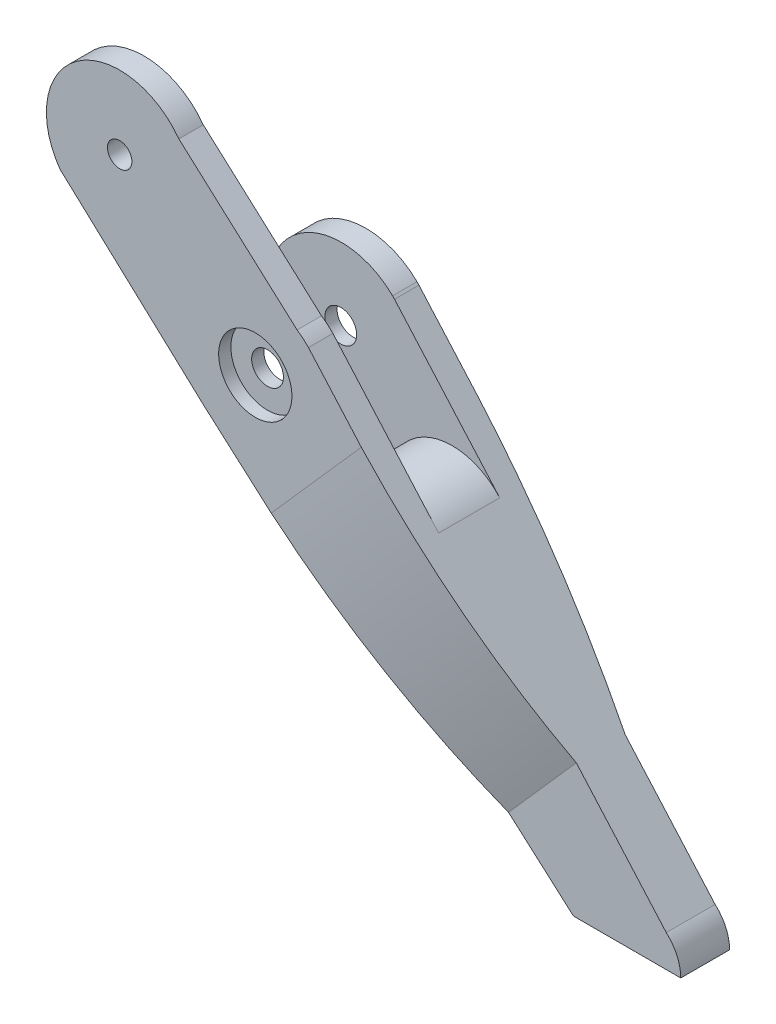
ISO-10303-21;
HEADER;
FILE_DESCRIPTION(('STEP AP214'),'2;1');
FILE_NAME('part.step','',(''),(''),'','','');
FILE_SCHEMA(('AUTOMOTIVE_DESIGN { 1 0 10303 214 1 1 1 1 }'));
ENDSEC;
DATA;
#1=APPLICATION_CONTEXT('core data for automotive mechanical design processes');
#2=APPLICATION_PROTOCOL_DEFINITION('international standard','automotive_design',2000,#1);
#3=PRODUCT_CONTEXT('',#1,'mechanical');
#4=PRODUCT('Part','Part','',(#3));
#5=PRODUCT_RELATED_PRODUCT_CATEGORY('part','',(#4));
#6=PRODUCT_DEFINITION_FORMATION('','',#4);
#7=PRODUCT_DEFINITION_CONTEXT('part definition',#1,'design');
#8=PRODUCT_DEFINITION('design','',#6,#7);
#9=PRODUCT_DEFINITION_SHAPE('','',#8);
#10=(LENGTH_UNIT() NAMED_UNIT(*) SI_UNIT(.MILLI.,.METRE.));
#11=(NAMED_UNIT(*) PLANE_ANGLE_UNIT() SI_UNIT($,.RADIAN.));
#12=(NAMED_UNIT(*) SI_UNIT($,.STERADIAN.) SOLID_ANGLE_UNIT());
#13=UNCERTAINTY_MEASURE_WITH_UNIT(LENGTH_MEASURE(1.E-05),#10,'distance_accuracy_value','');
#14=(GEOMETRIC_REPRESENTATION_CONTEXT(3) GLOBAL_UNCERTAINTY_ASSIGNED_CONTEXT((#13)) GLOBAL_UNIT_ASSIGNED_CONTEXT((#10,
#11,#12)) REPRESENTATION_CONTEXT('',''));
#15=CARTESIAN_POINT('',(0.,0.,0.));
#16=DIRECTION('',(0.,0.,1.));
#17=DIRECTION('',(1.,0.,0.));
#18=AXIS2_PLACEMENT_3D('',#15,#16,#17);
#19=CARTESIAN_POINT('',(-27.9049421413444,43.6443859527806,-3.));
#20=DIRECTION('',(0.,0.,1.));
#21=DIRECTION('',(1.,0.,0.));
#22=AXIS2_PLACEMENT_3D('',#19,#20,#21);
#23=CYLINDRICAL_SURFACE('',#22,2.6);
#24=CARTESIAN_POINT('',(-27.9049421413444,43.6443859527806,10.));
#25=DIRECTION('',(0.,0.,-1.));
#26=DIRECTION('',(-1.,0.,0.));
#27=AXIS2_PLACEMENT_3D('',#24,#25,#26);
#28=CIRCLE('',#27,2.6);
#29=CARTESIAN_POINT('',(-30.5049421413444,43.6443859527806,10.));
#30=VERTEX_POINT('',#29);
#31=EDGE_CURVE('E445',#30,#30,#28,.F.);
#32=ORIENTED_EDGE('',*,*,#31,.F.);
#33=EDGE_LOOP('',(#32));
#34=FACE_BOUND('',#33,.T.);
#35=CARTESIAN_POINT('',(-27.9049421413444,43.6443859527806,12.));
#36=DIRECTION('',(0.,0.,1.));
#37=DIRECTION('',(1.,0.,0.));
#38=AXIS2_PLACEMENT_3D('',#35,#36,#37);
#39=CIRCLE('',#38,2.6);
#40=CARTESIAN_POINT('',(-25.3049421413444,43.6443859527806,12.));
#41=VERTEX_POINT('',#40);
#42=EDGE_CURVE('E68',#41,#41,#39,.F.);
#43=ORIENTED_EDGE('',*,*,#42,.F.);
#44=EDGE_LOOP('',(#43));
#45=FACE_BOUND('',#44,.T.);
#46=ADVANCED_FACE('F63',(#34,#45),#23,.F.);
#47=CARTESIAN_POINT('',(-27.9049421413444,43.6443859527806,-4.));
#48=DIRECTION('',(0.,0.,1.));
#49=DIRECTION('',(1.,0.,0.));
#50=AXIS2_PLACEMENT_3D('',#47,#48,#49);
#51=CYLINDRICAL_SURFACE('',#50,2.6);
#52=CARTESIAN_POINT('',(-27.9049421413444,43.6443859527806,0.));
#53=DIRECTION('',(0.,0.,1.));
#54=DIRECTION('',(1.,0.,0.));
#55=AXIS2_PLACEMENT_3D('',#52,#53,#54);
#56=CIRCLE('',#55,2.6);
#57=CARTESIAN_POINT('',(-25.3049421413444,43.6443859527806,0.));
#58=VERTEX_POINT('',#57);
#59=EDGE_CURVE('E247',#58,#58,#56,.T.);
#60=ORIENTED_EDGE('',*,*,#59,.T.);
#61=EDGE_LOOP('',(#60));
#62=FACE_BOUND('',#61,.T.);
#63=CARTESIAN_POINT('',(-27.9049421413444,43.6443859527806,-2.));
#64=DIRECTION('',(0.,0.,-1.));
#65=DIRECTION('',(-1.,0.,0.));
#66=AXIS2_PLACEMENT_3D('',#63,#64,#65);
#67=CIRCLE('',#66,2.6);
#68=CARTESIAN_POINT('',(-30.5049421413444,43.6443859527806,-2.));
#69=VERTEX_POINT('',#68);
#70=EDGE_CURVE('E226',#69,#69,#67,.F.);
#71=ORIENTED_EDGE('',*,*,#70,.F.);
#72=EDGE_LOOP('',(#71));
#73=FACE_BOUND('',#72,.T.);
#74=ADVANCED_FACE('F259',(#62,#73),#51,.F.);
#75=CARTESIAN_POINT('',(-9.65317009659343,25.3894867406212,13.4327814635894));
#76=DIRECTION('',(0.,0.,-1.));
#77=DIRECTION('',(-1.,0.,0.));
#78=AXIS2_PLACEMENT_3D('',#75,#76,#77);
#79=CYLINDRICAL_SURFACE('',#78,10.3712235631253);
#80=DIRECTION('',(0.,0.,-1.));
#81=VECTOR('',#80,1.);
#82=CARTESIAN_POINT('',(-16.5173740886252,17.614849658925,14.));
#83=LINE('',#82,#81);
#84=CARTESIAN_POINT('',(-16.5173740886257,17.6148496589244,10.));
#85=VERTEX_POINT('',#84);
#86=CARTESIAN_POINT('',(-16.5173740886252,17.614849658925,0.));
#87=VERTEX_POINT('',#86);
#88=EDGE_CURVE('E289',#85,#87,#83,.T.);
#89=ORIENTED_EDGE('',*,*,#88,.F.);
#90=CARTESIAN_POINT('',(-9.65317009659343,25.3894867406212,10.));
#91=DIRECTION('',(0.,0.,-1.));
#92=DIRECTION('',(-1.,0.,0.));
#93=AXIS2_PLACEMENT_3D('',#90,#91,#92);
#94=CIRCLE('',#93,10.3712235631253);
#95=CARTESIAN_POINT('',(-1.87216606940496,32.2464725598571,10.));
#96=VERTEX_POINT('',#95);
#97=EDGE_CURVE('E12',#96,#85,#94,.F.);
#98=ORIENTED_EDGE('',*,*,#97,.F.);
#99=DIRECTION('',(0.,0.,-1.));
#100=VECTOR('',#99,1.);
#101=CARTESIAN_POINT('',(-1.87216606940547,32.2464725598567,14.));
#102=LINE('',#101,#100);
#103=CARTESIAN_POINT('',(-1.87216606940547,32.2464725598567,0.));
#104=VERTEX_POINT('',#103);
#105=EDGE_CURVE('E296',#104,#96,#102,.F.);
#106=ORIENTED_EDGE('',*,*,#105,.F.);
#107=CARTESIAN_POINT('',(-9.65317009659343,25.3894867406212,0.));
#108=DIRECTION('',(0.,0.,-1.));
#109=DIRECTION('',(-1.,0.,0.));
#110=AXIS2_PLACEMENT_3D('',#107,#108,#109);
#111=CIRCLE('',#110,10.3712235631253);
#112=EDGE_CURVE('E74',#87,#104,#111,.T.);
#113=ORIENTED_EDGE('',*,*,#112,.F.);
#114=EDGE_LOOP('',(#89,#98,#106,#113));
#115=FACE_BOUND('',#114,.T.);
#116=ADVANCED_FACE('F66',(#115),#79,.T.);
#117=CARTESIAN_POINT('',(0.671572776221725,-6.94016349284711,0.));
#118=CARTESIAN_POINT('',(-13.1859163983363,8.78470190959758,-3.88183674365132));
#119=CARTESIAN_POINT('',(-27.2509351479165,24.7450626888124,-4.));
#120=B_SPLINE_CURVE_WITH_KNOTS('',2,(#117,#118,#119),.UNSPECIFIED.,.F.,.F.,(3,3),(0.,1.),.UNSPECIFIED.);
#121=DIRECTION('',(0.750249377985996,0.661154952209862,0.));
#122=VECTOR('',#121,1.);
#123=SURFACE_OF_LINEAR_EXTRUSION('',#120,#122);
#124=CARTESIAN_POINT('',(-25.9208757969903,25.9171733928007,-4.));
#125=CARTESIAN_POINT('',(-24.588837421596,24.7411206667581,-3.99022062547783));
#126=CARTESIAN_POINT('',(-23.2568769003931,23.5651366779498,-3.96101966543624));
#127=CARTESIAN_POINT('',(-20.5937119018394,21.2138362092052,-3.86367306561646));
#128=CARTESIAN_POINT('',(-19.2625074510679,20.0385197527356,-3.79552613241683));
#129=CARTESIAN_POINT('',(-16.6018779997232,17.6894579110923,-3.62020875542696));
#130=CARTESIAN_POINT('',(-15.2724526359131,16.5157122052179,-3.51304812707628));
#131=CARTESIAN_POINT('',(-12.6157363839593,14.1701053156962,-3.25970066968625));
#132=CARTESIAN_POINT('',(-11.2884454284125,12.9982440725391,-3.11351509837658));
#133=CARTESIAN_POINT('',(-8.62731774653096,10.6487423446343,-2.78102212776162));
#134=CARTESIAN_POINT('',(-7.29350023196055,9.4711188218964,-2.59444105487763));
#135=CARTESIAN_POINT('',(-4.62932807548959,7.11892913641746,-2.18192237635344));
#136=CARTESIAN_POINT('',(-3.2989733376645,5.94436288898497,-1.95598587295653));
#137=CARTESIAN_POINT('',(-0.639728528010104,3.59652354337824,-1.46448977224725));
#138=CARTESIAN_POINT('',(0.689153570870428,2.42325748449679,-1.19885343086207));
#139=CARTESIAN_POINT('',(3.34224622642037,0.0808498574795639,-0.628590607779087));
#140=CARTESIAN_POINT('',(4.66645665337855,-1.08829159613454,-0.323963052091235));
#141=CARTESIAN_POINT('',(5.98800005315479,-2.25507833936965,0.));
#142=B_SPLINE_CURVE_WITH_KNOTS('',3,(#124,#125,#126,#127,#128,#129,#130,#131,#132,#133,#134,
#135,#136,#137,#138,#139,#140,#141),.UNSPECIFIED.,.F.,.F.,(4,2,2,2,2,2,2,2,4),(0.,
5.3307236354528,10.6616243180409,15.9911847273041,21.3205733916092,26.6872655196563,
32.0538073647705,37.4308608113082,42.8080623975034),.UNSPECIFIED.);
#143=CARTESIAN_POINT('',(-24.7128415251115,24.850603521512,-3.98579838559611));
#144=VERTEX_POINT('',#143);
#145=CARTESIAN_POINT('',(5.98800005315479,-2.25507833936965,0.));
#146=VERTEX_POINT('',#145);
#147=EDGE_CURVE('E236',#144,#146,#142,.T.);
#148=ORIENTED_EDGE('',*,*,#147,.F.);
#149=CARTESIAN_POINT('',(-24.7128415251115,24.850603521512,-3.98579838559611));
#150=CARTESIAN_POINT('',(-22.1348600164907,27.4776327844446,-3.98905232768544));
#151=CARTESIAN_POINT('',(-19.5568783081088,30.104662250939,-3.9918627665971));
#152=CARTESIAN_POINT('',(-14.4009144918225,35.3587215910514,-3.99659663806507));
#153=CARTESIAN_POINT('',(-11.8229323839181,37.9857514646694,-3.99852007062137));
#154=CARTESIAN_POINT('',(-9.2449500762526,40.6127815418491,-4.));
#155=B_SPLINE_CURVE_WITH_KNOTS('',3,(#149,#150,#151,#152,#153,#154),.UNSPECIFIED.,.F.,.F.,(4,2,
4),(0.,11.0419895239191,22.0839790478383),.UNSPECIFIED.);
#156=CARTESIAN_POINT('',(-9.24495007625259,40.6127815418491,-4.));
#157=VERTEX_POINT('',#156);
#158=EDGE_CURVE('E280',#144,#157,#155,.T.);
#159=ORIENTED_EDGE('',*,*,#158,.T.);
#160=CARTESIAN_POINT('',(18.6775578478857,8.9275553601896,0.));
#161=CARTESIAN_POINT('',(4.82006867332763,24.6524207626343,-3.88183674365132));
#162=CARTESIAN_POINT('',(-9.2449500762526,40.6127815418491,-4.));
#163=B_SPLINE_CURVE_WITH_KNOTS('',2,(#160,#161,#162),.UNSPECIFIED.,.F.,.F.,(3,3),(0.,1.),.UNSPECIFIED.);
#164=CARTESIAN_POINT('',(18.6775578478857,8.9275553601896,0.));
#165=VERTEX_POINT('',#164);
#166=EDGE_CURVE('E400',#165,#157,#163,.T.);
#167=ORIENTED_EDGE('',*,*,#166,.F.);
#168=DIRECTION('',(0.750249377985996,0.661154952209862,0.));
#169=VECTOR('',#168,1.);
#170=CARTESIAN_POINT('',(0.671572776221735,-6.9401634928471,0.));
#171=LINE('',#170,#169);
#172=EDGE_CURVE('E290',#146,#165,#171,.T.);
#173=ORIENTED_EDGE('',*,*,#172,.F.);
#174=EDGE_LOOP('',(#148,#159,#167,#173));
#175=FACE_BOUND('',#174,.T.);
#176=ADVANCED_FACE('F249',(#175),#123,.T.);
#177=CARTESIAN_POINT('',(-27.7916222926783,43.5310661041145,14.));
#178=DIRECTION('',(0.,0.,-1.));
#179=DIRECTION('',(-1.,0.,0.));
#180=AXIS2_PLACEMENT_3D('',#177,#178,#179);
#181=CYLINDRICAL_SURFACE('',#180,12.);
#182=CARTESIAN_POINT('',(-27.7916222926783,43.5310661041145,10.));
#183=DIRECTION('',(0.,0.,-1.));
#184=DIRECTION('',(-1.,0.,0.));
#185=AXIS2_PLACEMENT_3D('',#182,#183,#184);
#186=CIRCLE('',#185,12.);
#187=CARTESIAN_POINT('',(-21.055875116344,53.4623152690737,10.));
#188=VERTEX_POINT('',#187);
#189=CARTESIAN_POINT('',(-19.1937777895665,51.9022709098942,10.));
#190=VERTEX_POINT('',#189);
#191=EDGE_CURVE('E453',#188,#190,#186,.T.);
#192=ORIENTED_EDGE('',*,*,#191,.F.);
#193=DIRECTION('',(0.,0.,1.));
#194=VECTOR('',#193,1.);
#195=CARTESIAN_POINT('',(-21.055875116344,53.4623152690737,10.));
#196=LINE('',#195,#194);
#197=CARTESIAN_POINT('',(-21.055875116344,53.4623152690737,14.));
#198=VERTEX_POINT('',#197);
#199=EDGE_CURVE('E208',#188,#198,#196,.T.);
#200=ORIENTED_EDGE('',*,*,#199,.T.);
#201=CARTESIAN_POINT('',(-27.7916222926783,43.5310661041145,14.));
#202=DIRECTION('',(0.,0.,1.));
#203=DIRECTION('',(-1.,0.,0.));
#204=AXIS2_PLACEMENT_3D('',#201,#202,#203);
#205=CIRCLE('',#204,12.);
#206=CARTESIAN_POINT('',(-19.1937777895665,51.9022709098942,14.));
#207=VERTEX_POINT('',#206);
#208=EDGE_CURVE('E432',#207,#198,#205,.T.);
#209=ORIENTED_EDGE('',*,*,#208,.F.);
#210=DIRECTION('',(0.,0.,-1.));
#211=VECTOR('',#210,1.);
#212=CARTESIAN_POINT('',(-19.1937777895665,51.9022709098942,14.));
#213=LINE('',#212,#211);
#214=EDGE_CURVE('E430',#207,#190,#213,.T.);
#215=ORIENTED_EDGE('',*,*,#214,.T.);
#216=EDGE_LOOP('',(#192,#200,#209,#215));
#217=FACE_BOUND('',#216,.T.);
#218=ADVANCED_FACE('F354',(#217),#181,.T.);
#219=CARTESIAN_POINT('',(18.2005205169488,-13.0374763908109,14.));
#220=DIRECTION('',(0.,1.,0.));
#221=DIRECTION('',(-1.,0.,0.));
#222=AXIS2_PLACEMENT_3D('',#219,#220,#221);
#223=PLANE('',#222);
#224=DIRECTION('',(0.,0.,-1.));
#225=VECTOR('',#224,1.);
#226=CARTESIAN_POINT('',(35.7769202021713,-13.0374763908109,14.));
#227=LINE('',#226,#225);
#228=CARTESIAN_POINT('',(35.7769202021713,-13.0374763908109,8.));
#229=VERTEX_POINT('',#228);
#230=CARTESIAN_POINT('',(35.7769202021713,-13.0374763908109,0.));
#231=VERTEX_POINT('',#230);
#232=EDGE_CURVE('E443',#229,#231,#227,.T.);
#233=ORIENTED_EDGE('',*,*,#232,.F.);
#234=DIRECTION('',(-1.,0.,0.));
#235=VECTOR('',#234,1.);
#236=CARTESIAN_POINT('',(18.2005205169488,-13.0374763908109,8.));
#237=LINE('',#236,#235);
#238=CARTESIAN_POINT('',(18.2005205169488,-13.0374763908109,8.));
#239=VERTEX_POINT('',#238);
#240=EDGE_CURVE('E449',#229,#239,#237,.T.);
#241=ORIENTED_EDGE('',*,*,#240,.T.);
#242=DIRECTION('',(0.,0.,-1.));
#243=VECTOR('',#242,1.);
#244=CARTESIAN_POINT('',(18.2005205169488,-13.0374763908109,14.));
#245=LINE('',#244,#243);
#246=CARTESIAN_POINT('',(18.2005205169488,-13.0374763908109,0.));
#247=VERTEX_POINT('',#246);
#248=EDGE_CURVE('E417',#239,#247,#245,.T.);
#249=ORIENTED_EDGE('',*,*,#248,.T.);
#250=DIRECTION('',(1.,0.,0.));
#251=VECTOR('',#250,1.);
#252=CARTESIAN_POINT('',(18.2005205169488,-13.0374763908109,0.));
#253=LINE('',#252,#251);
#254=EDGE_CURVE('E465',#247,#231,#253,.T.);
#255=ORIENTED_EDGE('',*,*,#254,.T.);
#256=EDGE_LOOP('',(#233,#241,#249,#255));
#257=FACE_BOUND('',#256,.T.);
#258=ADVANCED_FACE('F357',(#257),#223,.F.);
#259=CARTESIAN_POINT('',(28.7769202022435,-13.0374763908109,14.));
#260=DIRECTION('',(0.,0.,-1.));
#261=DIRECTION('',(-1.,0.,0.));
#262=AXIS2_PLACEMENT_3D('',#259,#260,#261);
#263=CYLINDRICAL_SURFACE('',#262,6.99999999992777);
#264=DIRECTION('',(0.,0.,-1.));
#265=VECTOR('',#264,1.);
#266=CARTESIAN_POINT('',(33.4098767334832,-7.79002807961883,14.));
#267=LINE('',#266,#265);
#268=CARTESIAN_POINT('',(33.4098767334832,-7.79002807961883,8.));
#269=VERTEX_POINT('',#268);
#270=CARTESIAN_POINT('',(33.4098767334832,-7.79002807961883,0.));
#271=VERTEX_POINT('',#270);
#272=EDGE_CURVE('E440',#269,#271,#267,.T.);
#273=ORIENTED_EDGE('',*,*,#272,.F.);
#274=CARTESIAN_POINT('',(28.7769202022435,-13.0374763908109,8.));
#275=DIRECTION('',(0.,0.,-1.));
#276=DIRECTION('',(-1.,0.,0.));
#277=AXIS2_PLACEMENT_3D('',#274,#275,#276);
#278=CIRCLE('',#277,6.99999999992777);
#279=EDGE_CURVE('E455',#269,#229,#278,.T.);
#280=ORIENTED_EDGE('',*,*,#279,.T.);
#281=ORIENTED_EDGE('',*,*,#232,.T.);
#282=CARTESIAN_POINT('',(28.7769202022435,-13.0374763908109,0.));
#283=DIRECTION('',(0.,0.,1.));
#284=DIRECTION('',(1.,0.,0.));
#285=AXIS2_PLACEMENT_3D('',#282,#283,#284);
#286=CIRCLE('',#285,6.99999999992777);
#287=EDGE_CURVE('E474',#231,#271,#286,.T.);
#288=ORIENTED_EDGE('',*,*,#287,.T.);
#289=EDGE_LOOP('',(#273,#280,#281,#288));
#290=FACE_BOUND('',#289,.T.);
#291=ADVANCED_FACE('F362',(#290),#263,.T.);
#292=CARTESIAN_POINT('',(-19.1937777895665,51.9022709098942,14.));
#293=DIRECTION('',(-0.750249377985996,-0.661154952209862,0.));
#294=DIRECTION('',(0.661154952209862,-0.750249377985997,0.));
#295=AXIS2_PLACEMENT_3D('',#292,#293,#294);
#296=PLANE('',#295);
#297=ORIENTED_EDGE('',*,*,#105,.T.);
#298=DIRECTION('',(0.661154952209862,-0.750249377985997,0.));
#299=VECTOR('',#298,1.);
#300=CARTESIAN_POINT('',(-19.1937777895665,51.9022709098942,10.));
#301=LINE('',#300,#299);
#302=EDGE_CURVE('E87',#190,#96,#301,.T.);
#303=ORIENTED_EDGE('',*,*,#302,.F.);
#304=ORIENTED_EDGE('',*,*,#214,.F.);
#305=DIRECTION('',(-0.661154952209862,0.750249377985997,0.));
#306=VECTOR('',#305,1.);
#307=CARTESIAN_POINT('',(-19.1937777895665,51.9022709098942,14.));
#308=LINE('',#307,#306);
#309=CARTESIAN_POINT('',(-10.5421023651085,42.0847325491197,14.));
#310=VERTEX_POINT('',#309);
#311=EDGE_CURVE('E466',#310,#207,#308,.T.);
#312=ORIENTED_EDGE('',*,*,#311,.F.);
#313=CARTESIAN_POINT('',(-10.5421023651085,42.0847325491197,14.));
#314=CARTESIAN_POINT('',(-9.29116794678438,40.6652275357911,13.9656176360731));
#315=CARTESIAN_POINT('',(-8.04053048900444,39.246059500145,13.9045230868265));
#316=CARTESIAN_POINT('',(-5.54092311552883,36.4096156818068,13.7278499774469));
#317=CARTESIAN_POINT('',(-4.29195322597862,34.9923399287836,13.6122705728873));
#318=CARTESIAN_POINT('',(-1.79675644412734,32.1609010546142,13.3255648602548));
#319=CARTESIAN_POINT('',(-0.55052963429707,30.7467380270524,13.1544369044712));
#320=CARTESIAN_POINT('',(1.93799393706674,27.9228716167974,12.7557777541679));
#321=CARTESIAN_POINT('',(3.18029065862422,26.5131682794673,12.5282459877766));
#322=CARTESIAN_POINT('',(5.62041937882687,23.7442182044224,12.0242210117392));
#323=CARTESIAN_POINT('',(6.81841220558213,22.3847889660863,11.7495091377435));
#324=CARTESIAN_POINT('',(9.20850693344129,19.6726152511191,11.1461201042127));
#325=CARTESIAN_POINT('',(10.4006085479129,18.3198710997458,10.8174403450287));
#326=CARTESIAN_POINT('',(12.7784403387277,15.6216128229963,10.1056527901271));
#327=CARTESIAN_POINT('',(13.9641662275106,14.2761035629539,9.72251220994619));
#328=CARTESIAN_POINT('',(16.3273441235868,11.5944738773932,8.90196051998719));
#329=CARTESIAN_POINT('',(17.5047963649292,10.2583531862864,8.46455095198088));
#330=CARTESIAN_POINT('',(18.6775578478856,8.92755536018961,8.));
#331=B_SPLINE_CURVE_WITH_KNOTS('',3,(#313,#314,#315,#316,#317,#318,#319,#320,#321,#322,#323,
#324,#325,#326,#327,#328,#329,#330),.UNSPECIFIED.,.F.,.F.,(4,2,2,2,2,2,2,2,4),(0.,
5.6769352825752,11.3539585512948,17.031150230288,22.7083994720253,28.205624966388,
33.703115341433,39.2039292364952,44.7045868902376),.UNSPECIFIED.);
#332=CARTESIAN_POINT('',(18.6775578478856,8.9275553601896,8.));
#333=VERTEX_POINT('',#332);
#334=EDGE_CURVE('E365',#310,#333,#331,.T.);
#335=ORIENTED_EDGE('',*,*,#334,.T.);
#336=DIRECTION('',(0.661154952209862,-0.750249377985997,0.));
#337=VECTOR('',#336,1.);
#338=CARTESIAN_POINT('',(-19.1937777895665,51.9022709098942,8.));
#339=LINE('',#338,#337);
#340=EDGE_CURVE('E374',#333,#269,#339,.T.);
#341=ORIENTED_EDGE('',*,*,#340,.T.);
#342=ORIENTED_EDGE('',*,*,#272,.T.);
#343=DIRECTION('',(-0.661154952209862,0.750249377985997,0.));
#344=VECTOR('',#343,1.);
#345=CARTESIAN_POINT('',(-19.1937777895665,51.9022709098942,0.));
#346=LINE('',#345,#344);
#347=EDGE_CURVE('E477',#271,#165,#346,.T.);
#348=ORIENTED_EDGE('',*,*,#347,.T.);
#349=ORIENTED_EDGE('',*,*,#166,.T.);
#350=DIRECTION('',(0.661154952209862,-0.750249377985997,0.));
#351=VECTOR('',#350,1.);
#352=CARTESIAN_POINT('',(33.9875890894061,-8.44559049238946,-4.));
#353=LINE('',#352,#351);
#354=CARTESIAN_POINT('',(-19.1009491503632,51.7969330785904,-4.));
#355=VERTEX_POINT('',#354);
#356=EDGE_CURVE('E524',#355,#157,#353,.T.);
#357=ORIENTED_EDGE('',*,*,#356,.F.);
#358=DIRECTION('',(0.,0.,1.));
#359=VECTOR('',#358,1.);
#360=CARTESIAN_POINT('',(-19.1009491503632,51.7969330785904,-4.));
#361=LINE('',#360,#359);
#362=CARTESIAN_POINT('',(-19.1009491503632,51.7969330785904,0.));
#363=VERTEX_POINT('',#362);
#364=EDGE_CURVE('E516',#355,#363,#361,.T.);
#365=ORIENTED_EDGE('',*,*,#364,.T.);
#366=DIRECTION('',(0.661154952209862,-0.750249377985997,0.));
#367=VECTOR('',#366,1.);
#368=CARTESIAN_POINT('',(33.9875890894061,-8.44559049238946,0.));
#369=LINE('',#368,#367);
#370=EDGE_CURVE('E532',#363,#104,#369,.T.);
#371=ORIENTED_EDGE('',*,*,#370,.T.);
#372=EDGE_LOOP('',(#297,#303,#304,#312,#335,#341,#342,#348,#349,#357,#365,#371));
#373=FACE_BOUND('',#372,.T.);
#374=ADVANCED_FACE('F352',(#373),#296,.F.);
#375=CARTESIAN_POINT('',(-36.3894667957902,35.1598612983348,14.));
#376=DIRECTION('',(0.661850933041092,0.749635473035152,0.));
#377=DIRECTION('',(-0.749635473035152,0.661850933041092,0.));
#378=AXIS2_PLACEMENT_3D('',#375,#376,#377);
#379=PLANE('',#378);
#380=DIRECTION('',(-0.749635473035152,0.661850933041092,0.));
#381=VECTOR('',#380,1.);
#382=CARTESIAN_POINT('',(-36.3894667957902,35.1598612983348,10.));
#383=LINE('',#382,#381);
#384=CARTESIAN_POINT('',(-36.3894667957902,35.1598612983348,10.));
#385=VERTEX_POINT('',#384);
#386=EDGE_CURVE('E448',#85,#385,#383,.T.);
#387=ORIENTED_EDGE('',*,*,#386,.F.);
#388=ORIENTED_EDGE('',*,*,#88,.T.);
#389=DIRECTION('',(-0.749635473035152,0.661850933041092,0.));
#390=VECTOR('',#389,1.);
#391=CARTESIAN_POINT('',(24.1439636710036,-18.2849247020029,0.));
#392=LINE('',#391,#390);
#393=CARTESIAN_POINT('',(-36.3894667957902,35.1598612983348,0.));
#394=VERTEX_POINT('',#393);
#395=EDGE_CURVE('E529',#87,#394,#392,.T.);
#396=ORIENTED_EDGE('',*,*,#395,.T.);
#397=DIRECTION('',(0.,0.,1.));
#398=VECTOR('',#397,1.);
#399=CARTESIAN_POINT('',(-36.3894667957902,35.1598612983348,-4.));
#400=LINE('',#399,#398);
#401=CARTESIAN_POINT('',(-36.3894667957902,35.1598612983348,-4.));
#402=VERTEX_POINT('',#401);
#403=EDGE_CURVE('E496',#402,#394,#400,.T.);
#404=ORIENTED_EDGE('',*,*,#403,.F.);
#405=DIRECTION('',(-0.749635473035152,0.661850933041092,0.));
#406=VECTOR('',#405,1.);
#407=CARTESIAN_POINT('',(24.1439636710036,-18.2849247020029,-4.));
#408=LINE('',#407,#406);
#409=CARTESIAN_POINT('',(-24.7128415251115,24.850603521512,-4.));
#410=VERTEX_POINT('',#409);
#411=EDGE_CURVE('E542',#410,#402,#408,.T.);
#412=ORIENTED_EDGE('',*,*,#411,.F.);
#413=DIRECTION('',(0.,0.,1.));
#414=VECTOR('',#413,1.);
#415=CARTESIAN_POINT('',(-24.7128415251115,24.850603521512,-4.));
#416=LINE('',#415,#414);
#417=EDGE_CURVE('E494',#410,#144,#416,.T.);
#418=ORIENTED_EDGE('',*,*,#417,.T.);
#419=ORIENTED_EDGE('',*,*,#147,.T.);
#420=DIRECTION('',(0.749635473035152,-0.661850933041092,0.));
#421=VECTOR('',#420,1.);
#422=CARTESIAN_POINT('',(-36.3894667957902,35.1598612983348,0.));
#423=LINE('',#422,#421);
#424=EDGE_CURVE('E419',#146,#247,#423,.T.);
#425=ORIENTED_EDGE('',*,*,#424,.T.);
#426=ORIENTED_EDGE('',*,*,#248,.F.);
#427=DIRECTION('',(0.749635473035151,-0.661850933041092,0.));
#428=VECTOR('',#427,1.);
#429=CARTESIAN_POINT('',(7.57071000925828,-3.65244825963142,8.));
#430=LINE('',#429,#428);
#431=CARTESIAN_POINT('',(7.57071000925828,-3.65244825963142,8.));
#432=VERTEX_POINT('',#431);
#433=EDGE_CURVE('E399',#432,#239,#430,.T.);
#434=ORIENTED_EDGE('',*,*,#433,.F.);
#435=CARTESIAN_POINT('',(-25.3002076229534,25.3691873050666,14.));
#436=CARTESIAN_POINT('',(-8.2891397006846,10.350165952203,13.5840734224017));
#437=CARTESIAN_POINT('',(7.57071000925828,-3.65244825963142,8.));
#438=B_SPLINE_CURVE_WITH_KNOTS('',2,(#435,#436,#437),.UNSPECIFIED.,.F.,.F.,(3,3),(0.,1.),.UNSPECIFIED.);
#439=CARTESIAN_POINT('',(-25.3002076229534,25.3691873050666,14.));
#440=VERTEX_POINT('',#439);
#441=EDGE_CURVE('E391',#440,#432,#438,.T.);
#442=ORIENTED_EDGE('',*,*,#441,.F.);
#443=DIRECTION('',(0.749635473035152,-0.661850933041092,0.));
#444=VECTOR('',#443,1.);
#445=CARTESIAN_POINT('',(-36.3894667957902,35.1598612983348,14.));
#446=LINE('',#445,#444);
#447=CARTESIAN_POINT('',(-36.3894667957902,35.1598612983348,14.));
#448=VERTEX_POINT('',#447);
#449=EDGE_CURVE('E425',#448,#440,#446,.T.);
#450=ORIENTED_EDGE('',*,*,#449,.F.);
#451=DIRECTION('',(0.,0.,-1.));
#452=VECTOR('',#451,1.);
#453=CARTESIAN_POINT('',(-36.3894667957902,35.1598612983348,14.));
#454=LINE('',#453,#452);
#455=EDGE_CURVE('E424',#448,#385,#454,.T.);
#456=ORIENTED_EDGE('',*,*,#455,.T.);
#457=EDGE_LOOP('',(#387,#388,#396,#404,#412,#418,#419,#425,#426,#434,#442,#450,#456));
#458=FACE_BOUND('',#457,.T.);
#459=ADVANCED_FACE('F345',(#458),#379,.F.);
#460=CARTESIAN_POINT('',(28.7769202022435,-13.0374763908109,14.));
#461=DIRECTION('',(0.,0.,1.));
#462=DIRECTION('',(1.,0.,0.));
#463=AXIS2_PLACEMENT_3D('',#460,#461,#462);
#464=PLANE('',#463);
#465=CARTESIAN_POINT('',(-27.9049421413444,43.6443859527806,14.));
#466=DIRECTION('',(0.,0.,1.));
#467=DIRECTION('',(1.,0.,0.));
#468=AXIS2_PLACEMENT_3D('',#465,#466,#467);
#469=CIRCLE('',#468,6.);
#470=CARTESIAN_POINT('',(-21.9049421413444,43.6443859527806,14.));
#471=VERTEX_POINT('',#470);
#472=EDGE_CURVE('E316',#471,#471,#469,.T.);
#473=ORIENTED_EDGE('',*,*,#472,.F.);
#474=EDGE_LOOP('',(#473));
#475=FACE_BOUND('',#474,.T.);
#476=DIRECTION('',(-0.661850933041092,-0.749635473035151,0.));
#477=VECTOR('',#476,1.);
#478=CARTESIAN_POINT('',(-6.7683814978028,46.3589805500509,14.));
#479=LINE('',#478,#477);
#480=EDGE_CURVE('E291',#310,#440,#479,.T.);
#481=ORIENTED_EDGE('',*,*,#480,.F.);
#482=ORIENTED_EDGE('',*,*,#311,.T.);
#483=ORIENTED_EDGE('',*,*,#208,.T.);
#484=DIRECTION('',(-0.743653226936448,0.668565537600472,0.));
#485=VECTOR('',#484,1.);
#486=CARTESIAN_POINT('',(17.1688905695785,19.0971567586477,14.));
#487=LINE('',#486,#485);
#488=CARTESIAN_POINT('',(-40.4241950336145,70.8749892801212,14.));
#489=VERTEX_POINT('',#488);
#490=EDGE_CURVE('E225',#198,#489,#487,.T.);
#491=ORIENTED_EDGE('',*,*,#490,.T.);
#492=CARTESIAN_POINT('',(-50.1205987800494,63.8053531942874,14.));
#493=DIRECTION('',(0.,0.,1.));
#494=DIRECTION('',(1.,0.,0.));
#495=AXIS2_PLACEMENT_3D('',#492,#493,#494);
#496=CIRCLE('',#495,12.);
#497=CARTESIAN_POINT('',(-59.8971763480253,56.8470106432665,14.));
#498=VERTEX_POINT('',#497);
#499=EDGE_CURVE('E193',#489,#498,#496,.T.);
#500=ORIENTED_EDGE('',*,*,#499,.T.);
#501=DIRECTION('',(-0.734994695863325,0.678072855269091,0.));
#502=VECTOR('',#501,1.);
#503=CARTESIAN_POINT('',(0.791719160677087,0.858181210454286,14.));
#504=LINE('',#503,#502);
#505=EDGE_CURVE('E215',#448,#498,#504,.T.);
#506=ORIENTED_EDGE('',*,*,#505,.F.);
#507=ORIENTED_EDGE('',*,*,#449,.T.);
#508=EDGE_LOOP('',(#481,#482,#483,#491,#500,#506,#507));
#509=FACE_BOUND('',#508,.T.);
#510=CARTESIAN_POINT('',(-50.1205987800494,63.8053531942874,14.));
#511=DIRECTION('',(0.,0.,1.));
#512=DIRECTION('',(1.,0.,0.));
#513=AXIS2_PLACEMENT_3D('',#510,#511,#512);
#514=CIRCLE('',#513,2.);
#515=CARTESIAN_POINT('',(-48.1205987800493,63.8053531942874,14.));
#516=VERTEX_POINT('',#515);
#517=EDGE_CURVE('E221',#516,#516,#514,.T.);
#518=ORIENTED_EDGE('',*,*,#517,.F.);
#519=EDGE_LOOP('',(#518));
#520=FACE_BOUND('',#519,.T.);
#521=ADVANCED_FACE('F342',(#475,#509,#520),#464,.T.);
#522=CARTESIAN_POINT('',(28.7769202022435,-13.0374763908109,0.));
#523=DIRECTION('',(0.,0.,1.));
#524=DIRECTION('',(1.,0.,0.));
#525=AXIS2_PLACEMENT_3D('',#522,#523,#524);
#526=PLANE('',#525);
#527=ORIENTED_EDGE('',*,*,#424,.F.);
#528=ORIENTED_EDGE('',*,*,#172,.T.);
#529=ORIENTED_EDGE('',*,*,#347,.F.);
#530=ORIENTED_EDGE('',*,*,#287,.F.);
#531=ORIENTED_EDGE('',*,*,#254,.F.);
#532=EDGE_LOOP('',(#527,#528,#529,#530,#531));
#533=FACE_BOUND('',#532,.T.);
#534=ADVANCED_FACE('F344',(#533),#526,.F.);
#535=CARTESIAN_POINT('',(0.,0.,10.));
#536=DIRECTION('',(0.,0.,-1.));
#537=DIRECTION('',(-1.,0.,0.));
#538=AXIS2_PLACEMENT_3D('',#535,#536,#537);
#539=PLANE('',#538);
#540=ORIENTED_EDGE('',*,*,#31,.T.);
#541=EDGE_LOOP('',(#540));
#542=FACE_BOUND('',#541,.T.);
#543=ORIENTED_EDGE('',*,*,#302,.T.);
#544=ORIENTED_EDGE('',*,*,#97,.T.);
#545=ORIENTED_EDGE('',*,*,#386,.T.);
#546=DIRECTION('',(-0.734994695863325,0.678072855269091,0.));
#547=VECTOR('',#546,1.);
#548=CARTESIAN_POINT('',(0.791719160677087,0.858181210454286,10.));
#549=LINE('',#548,#547);
#550=CARTESIAN_POINT('',(-59.8971763480253,56.8470106432665,10.));
#551=VERTEX_POINT('',#550);
#552=EDGE_CURVE('E198',#385,#551,#549,.T.);
#553=ORIENTED_EDGE('',*,*,#552,.T.);
#554=CARTESIAN_POINT('',(-50.1205987800494,63.8053531942874,10.));
#555=DIRECTION('',(0.,0.,1.));
#556=DIRECTION('',(1.,0.,0.));
#557=AXIS2_PLACEMENT_3D('',#554,#555,#556);
#558=CIRCLE('',#557,12.);
#559=CARTESIAN_POINT('',(-40.4241950336145,70.8749892801212,10.));
#560=VERTEX_POINT('',#559);
#561=EDGE_CURVE('E191',#560,#551,#558,.T.);
#562=ORIENTED_EDGE('',*,*,#561,.F.);
#563=DIRECTION('',(-0.743653226936448,0.668565537600472,0.));
#564=VECTOR('',#563,1.);
#565=CARTESIAN_POINT('',(17.1688905695785,19.0971567586477,10.));
#566=LINE('',#565,#564);
#567=EDGE_CURVE('E82',#188,#560,#566,.T.);
#568=ORIENTED_EDGE('',*,*,#567,.F.);
#569=ORIENTED_EDGE('',*,*,#191,.T.);
#570=EDGE_LOOP('',(#543,#544,#545,#553,#562,#568,#569));
#571=FACE_BOUND('',#570,.T.);
#572=CARTESIAN_POINT('',(-50.1205987800494,63.8053531942874,10.));
#573=DIRECTION('',(0.,0.,1.));
#574=DIRECTION('',(1.,0.,0.));
#575=AXIS2_PLACEMENT_3D('',#572,#573,#574);
#576=CIRCLE('',#575,2.);
#577=CARTESIAN_POINT('',(-48.1205987800493,63.8053531942874,10.));
#578=VERTEX_POINT('',#577);
#579=EDGE_CURVE('E211',#578,#578,#576,.T.);
#580=ORIENTED_EDGE('',*,*,#579,.T.);
#581=EDGE_LOOP('',(#580));
#582=FACE_BOUND('',#581,.T.);
#583=ADVANCED_FACE('F200',(#542,#571,#582),#539,.T.);
#584=CARTESIAN_POINT('',(26.1025361344089,17.3373449853528,8.));
#585=DIRECTION('',(0.,0.,-1.));
#586=DIRECTION('',(-1.,0.,0.));
#587=AXIS2_PLACEMENT_3D('',#584,#585,#586);
#588=PLANE('',#587);
#589=ORIENTED_EDGE('',*,*,#279,.F.);
#590=ORIENTED_EDGE('',*,*,#340,.F.);
#591=DIRECTION('',(-0.661850933041092,-0.749635473035151,0.));
#592=VECTOR('',#591,1.);
#593=CARTESIAN_POINT('',(26.1025361344089,17.3373449853528,8.));
#594=LINE('',#593,#592);
#595=EDGE_CURVE('E375',#333,#432,#594,.T.);
#596=ORIENTED_EDGE('',*,*,#595,.T.);
#597=ORIENTED_EDGE('',*,*,#433,.T.);
#598=ORIENTED_EDGE('',*,*,#240,.F.);
#599=EDGE_LOOP('',(#589,#590,#596,#597,#598));
#600=FACE_BOUND('',#599,.T.);
#601=ADVANCED_FACE('F383',(#600),#588,.F.);
#602=CARTESIAN_POINT('',(-6.7683814978028,46.3589805500509,14.));
#603=CARTESIAN_POINT('',(10.242686424466,31.3399591971872,13.5840734224017));
#604=CARTESIAN_POINT('',(26.1025361344089,17.3373449853528,8.));
#605=B_SPLINE_CURVE_WITH_KNOTS('',2,(#602,#603,#604),.UNSPECIFIED.,.F.,.F.,(3,3),(0.,1.),.UNSPECIFIED.);
#606=DIRECTION('',(-0.661850933041092,-0.749635473035151,0.));
#607=VECTOR('',#606,1.);
#608=SURFACE_OF_LINEAR_EXTRUSION('',#605,#607);
#609=ORIENTED_EDGE('',*,*,#480,.T.);
#610=ORIENTED_EDGE('',*,*,#441,.T.);
#611=ORIENTED_EDGE('',*,*,#595,.F.);
#612=ORIENTED_EDGE('',*,*,#334,.F.);
#613=EDGE_LOOP('',(#609,#610,#611,#612));
#614=FACE_BOUND('',#613,.T.);
#615=ADVANCED_FACE('F378',(#614),#608,.F.);
#616=CARTESIAN_POINT('',(-3.06452593198223,-2.70060403321443,0.));
#617=DIRECTION('',(0.,0.,-1.));
#618=DIRECTION('',(-1.,0.,0.));
#619=AXIS2_PLACEMENT_3D('',#616,#617,#618);
#620=PLANE('',#619);
#621=ORIENTED_EDGE('',*,*,#395,.F.);
#622=ORIENTED_EDGE('',*,*,#112,.T.);
#623=ORIENTED_EDGE('',*,*,#370,.F.);
#624=CARTESIAN_POINT('',(-27.9049421413444,43.6443859527806,0.));
#625=DIRECTION('',(0.,0.,1.));
#626=DIRECTION('',(1.,0.,0.));
#627=AXIS2_PLACEMENT_3D('',#624,#625,#626);
#628=CIRCLE('',#627,11.9989298366061);
#629=CARTESIAN_POINT('',(-19.4204174868986,52.1289106072263,0.));
#630=VERTEX_POINT('',#629);
#631=EDGE_CURVE('E520',#363,#630,#628,.T.);
#632=ORIENTED_EDGE('',*,*,#631,.T.);
#633=CARTESIAN_POINT('',(-27.7916222926783,43.5310661041145,0.));
#634=DIRECTION('',(0.,0.,1.));
#635=DIRECTION('',(1.,0.,0.));
#636=AXIS2_PLACEMENT_3D('',#633,#634,#635);
#637=CIRCLE('',#636,12.);
#638=EDGE_CURVE('E525',#630,#394,#637,.T.);
#639=ORIENTED_EDGE('',*,*,#638,.T.);
#640=EDGE_LOOP('',(#621,#622,#623,#632,#639));
#641=FACE_BOUND('',#640,.T.);
#642=ORIENTED_EDGE('',*,*,#59,.F.);
#643=EDGE_LOOP('',(#642));
#644=FACE_BOUND('',#643,.T.);
#645=ADVANCED_FACE('F267',(#641,#644),#620,.F.);
#646=CARTESIAN_POINT('',(-27.7916222926783,43.5310661041145,-4.));
#647=DIRECTION('',(0.,0.,1.));
#648=DIRECTION('',(1.,0.,0.));
#649=AXIS2_PLACEMENT_3D('',#646,#647,#648);
#650=PLANE('',#649);
#651=CARTESIAN_POINT('',(-27.9049421413444,43.6443859527806,-4.));
#652=DIRECTION('',(0.,0.,-1.));
#653=DIRECTION('',(-1.,0.,0.));
#654=AXIS2_PLACEMENT_3D('',#651,#652,#653);
#655=CIRCLE('',#654,6.);
#656=CARTESIAN_POINT('',(-33.9049421413444,43.6443859527806,-4.));
#657=VERTEX_POINT('',#656);
#658=EDGE_CURVE('E309',#657,#657,#655,.T.);
#659=ORIENTED_EDGE('',*,*,#658,.F.);
#660=EDGE_LOOP('',(#659));
#661=FACE_BOUND('',#660,.T.);
#662=ORIENTED_EDGE('',*,*,#356,.T.);
#663=DIRECTION('',(-0.700412490247513,-0.71373828782354,0.));
#664=VECTOR('',#663,1.);
#665=CARTESIAN_POINT('',(-17.4126355030764,32.2897006528112,-4.));
#666=LINE('',#665,#664);
#667=EDGE_CURVE('E545',#157,#410,#666,.T.);
#668=ORIENTED_EDGE('',*,*,#667,.T.);
#669=ORIENTED_EDGE('',*,*,#411,.T.);
#670=CARTESIAN_POINT('',(-27.7916222926783,43.5310661041145,-4.));
#671=DIRECTION('',(0.,0.,1.));
#672=DIRECTION('',(1.,0.,0.));
#673=AXIS2_PLACEMENT_3D('',#670,#671,#672);
#674=CIRCLE('',#673,12.);
#675=CARTESIAN_POINT('',(-19.4204174868986,52.1289106072263,-4.));
#676=VERTEX_POINT('',#675);
#677=EDGE_CURVE('E538',#676,#402,#674,.T.);
#678=ORIENTED_EDGE('',*,*,#677,.F.);
#679=CARTESIAN_POINT('',(-27.9049421413444,43.6443859527806,-4.));
#680=DIRECTION('',(0.,0.,1.));
#681=DIRECTION('',(1.,0.,0.));
#682=AXIS2_PLACEMENT_3D('',#679,#680,#681);
#683=CIRCLE('',#682,11.9989298366061);
#684=EDGE_CURVE('E519',#355,#676,#683,.T.);
#685=ORIENTED_EDGE('',*,*,#684,.F.);
#686=EDGE_LOOP('',(#662,#668,#669,#678,#685));
#687=FACE_BOUND('',#686,.T.);
#688=ADVANCED_FACE('F263',(#661,#687),#650,.F.);
#689=CARTESIAN_POINT('',(-17.4126355030764,32.2897006528112,-4.));
#690=DIRECTION('',(-0.71373828782354,0.700412490247513,0.));
#691=DIRECTION('',(-0.700412490247513,-0.71373828782354,0.));
#692=AXIS2_PLACEMENT_3D('',#689,#690,#691);
#693=PLANE('',#692);
#694=ORIENTED_EDGE('',*,*,#158,.F.);
#695=ORIENTED_EDGE('',*,*,#417,.F.);
#696=ORIENTED_EDGE('',*,*,#667,.F.);
#697=EDGE_LOOP('',(#694,#695,#696));
#698=FACE_BOUND('',#697,.T.);
#699=ADVANCED_FACE('F266',(#698),#693,.F.);
#700=CARTESIAN_POINT('',(-27.7916222926783,43.5310661041145,-4.));
#701=DIRECTION('',(0.,0.,1.));
#702=DIRECTION('',(1.,0.,0.));
#703=AXIS2_PLACEMENT_3D('',#700,#701,#702);
#704=CYLINDRICAL_SURFACE('',#703,12.);
#705=ORIENTED_EDGE('',*,*,#638,.F.);
#706=DIRECTION('',(0.,0.,1.));
#707=VECTOR('',#706,1.);
#708=CARTESIAN_POINT('',(-19.4204174868986,52.1289106072263,-4.));
#709=LINE('',#708,#707);
#710=EDGE_CURVE('E513',#676,#630,#709,.T.);
#711=ORIENTED_EDGE('',*,*,#710,.F.);
#712=ORIENTED_EDGE('',*,*,#677,.T.);
#713=ORIENTED_EDGE('',*,*,#403,.T.);
#714=EDGE_LOOP('',(#705,#711,#712,#713));
#715=FACE_BOUND('',#714,.T.);
#716=ADVANCED_FACE('F272',(#715),#704,.T.);
#717=CARTESIAN_POINT('',(-27.9049421413444,43.6443859527806,-4.));
#718=DIRECTION('',(0.,0.,1.));
#719=DIRECTION('',(1.,0.,0.));
#720=AXIS2_PLACEMENT_3D('',#717,#718,#719);
#721=CYLINDRICAL_SURFACE('',#720,11.9989298366061);
#722=ORIENTED_EDGE('',*,*,#631,.F.);
#723=ORIENTED_EDGE('',*,*,#364,.F.);
#724=ORIENTED_EDGE('',*,*,#684,.T.);
#725=ORIENTED_EDGE('',*,*,#710,.T.);
#726=EDGE_LOOP('',(#722,#723,#724,#725));
#727=FACE_BOUND('',#726,.T.);
#728=ADVANCED_FACE('F269',(#727),#721,.T.);
#729=CARTESIAN_POINT('',(17.1688905695785,19.0971567586477,10.));
#730=DIRECTION('',(0.668565537600472,0.743653226936448,0.));
#731=DIRECTION('',(-0.743653226936448,0.668565537600472,0.));
#732=AXIS2_PLACEMENT_3D('',#729,#730,#731);
#733=PLANE('',#732);
#734=ORIENTED_EDGE('',*,*,#490,.F.);
#735=ORIENTED_EDGE('',*,*,#199,.F.);
#736=ORIENTED_EDGE('',*,*,#567,.T.);
#737=DIRECTION('',(0.,0.,1.));
#738=VECTOR('',#737,1.);
#739=CARTESIAN_POINT('',(-40.4241950336145,70.8749892801212,10.));
#740=LINE('',#739,#738);
#741=EDGE_CURVE('E189',#560,#489,#740,.T.);
#742=ORIENTED_EDGE('',*,*,#741,.T.);
#743=EDGE_LOOP('',(#734,#735,#736,#742));
#744=FACE_BOUND('',#743,.T.);
#745=ADVANCED_FACE('F206',(#744),#733,.T.);
#746=CARTESIAN_POINT('',(0.791719160677087,0.858181210454286,10.));
#747=DIRECTION('',(0.678072855269091,0.734994695863325,0.));
#748=DIRECTION('',(-0.734994695863325,0.678072855269091,0.));
#749=AXIS2_PLACEMENT_3D('',#746,#747,#748);
#750=PLANE('',#749);
#751=ORIENTED_EDGE('',*,*,#505,.T.);
#752=DIRECTION('',(0.,0.,1.));
#753=VECTOR('',#752,1.);
#754=CARTESIAN_POINT('',(-59.8971763480253,56.8470106432665,10.));
#755=LINE('',#754,#753);
#756=EDGE_CURVE('E197',#551,#498,#755,.T.);
#757=ORIENTED_EDGE('',*,*,#756,.F.);
#758=ORIENTED_EDGE('',*,*,#552,.F.);
#759=ORIENTED_EDGE('',*,*,#455,.F.);
#760=EDGE_LOOP('',(#751,#757,#758,#759));
#761=FACE_BOUND('',#760,.T.);
#762=ADVANCED_FACE('F646',(#761),#750,.F.);
#763=CARTESIAN_POINT('',(-50.1205987800494,63.8053531942874,10.));
#764=DIRECTION('',(0.,0.,1.));
#765=DIRECTION('',(1.,0.,0.));
#766=AXIS2_PLACEMENT_3D('',#763,#764,#765);
#767=CYLINDRICAL_SURFACE('',#766,2.);
#768=ORIENTED_EDGE('',*,*,#579,.F.);
#769=EDGE_LOOP('',(#768));
#770=FACE_BOUND('',#769,.T.);
#771=ORIENTED_EDGE('',*,*,#517,.T.);
#772=EDGE_LOOP('',(#771));
#773=FACE_BOUND('',#772,.T.);
#774=ADVANCED_FACE('F257',(#770,#773),#767,.F.);
#775=CARTESIAN_POINT('',(-50.1205987800494,63.8053531942874,10.));
#776=DIRECTION('',(0.,0.,1.));
#777=DIRECTION('',(1.,0.,0.));
#778=AXIS2_PLACEMENT_3D('',#775,#776,#777);
#779=CYLINDRICAL_SURFACE('',#778,12.);
#780=ORIENTED_EDGE('',*,*,#499,.F.);
#781=ORIENTED_EDGE('',*,*,#741,.F.);
#782=ORIENTED_EDGE('',*,*,#561,.T.);
#783=ORIENTED_EDGE('',*,*,#756,.T.);
#784=EDGE_LOOP('',(#780,#781,#782,#783));
#785=FACE_BOUND('',#784,.T.);
#786=ADVANCED_FACE('F190',(#785),#779,.T.);
#787=CARTESIAN_POINT('',(-27.9049421413444,43.6443859527806,-2.));
#788=DIRECTION('',(0.,0.,-1.));
#789=DIRECTION('',(-1.,0.,0.));
#790=AXIS2_PLACEMENT_3D('',#787,#788,#789);
#791=PLANE('',#790);
#792=CARTESIAN_POINT('',(-27.9049421413444,43.6443859527806,-2.));
#793=DIRECTION('',(0.,0.,-1.));
#794=DIRECTION('',(-1.,0.,0.));
#795=AXIS2_PLACEMENT_3D('',#792,#793,#794);
#796=CIRCLE('',#795,6.);
#797=CARTESIAN_POINT('',(-33.9049421413444,43.6443859527806,-2.));
#798=VERTEX_POINT('',#797);
#799=EDGE_CURVE('E304',#798,#798,#796,.T.);
#800=ORIENTED_EDGE('',*,*,#799,.T.);
#801=EDGE_LOOP('',(#800));
#802=FACE_BOUND('',#801,.T.);
#803=ORIENTED_EDGE('',*,*,#70,.T.);
#804=EDGE_LOOP('',(#803));
#805=FACE_BOUND('',#804,.T.);
#806=ADVANCED_FACE('F665',(#802,#805),#791,.T.);
#807=CARTESIAN_POINT('',(-27.9049421413444,43.6443859527806,-2.));
#808=DIRECTION('',(0.,0.,-1.));
#809=DIRECTION('',(-1.,0.,0.));
#810=AXIS2_PLACEMENT_3D('',#807,#808,#809);
#811=CYLINDRICAL_SURFACE('',#810,6.);
#812=ORIENTED_EDGE('',*,*,#799,.F.);
#813=EDGE_LOOP('',(#812));
#814=FACE_BOUND('',#813,.T.);
#815=ORIENTED_EDGE('',*,*,#658,.T.);
#816=EDGE_LOOP('',(#815));
#817=FACE_BOUND('',#816,.T.);
#818=ADVANCED_FACE('F683',(#814,#817),#811,.F.);
#819=CARTESIAN_POINT('',(-27.9049421413444,43.6443859527806,12.));
#820=DIRECTION('',(0.,0.,1.));
#821=DIRECTION('',(1.,0.,0.));
#822=AXIS2_PLACEMENT_3D('',#819,#820,#821);
#823=PLANE('',#822);
#824=CARTESIAN_POINT('',(-27.9049421413444,43.6443859527806,12.));
#825=DIRECTION('',(0.,0.,1.));
#826=DIRECTION('',(1.,0.,0.));
#827=AXIS2_PLACEMENT_3D('',#824,#825,#826);
#828=CIRCLE('',#827,6.);
#829=CARTESIAN_POINT('',(-21.9049421413444,43.6443859527806,12.));
#830=VERTEX_POINT('',#829);
#831=EDGE_CURVE('E320',#830,#830,#828,.T.);
#832=ORIENTED_EDGE('',*,*,#831,.T.);
#833=EDGE_LOOP('',(#832));
#834=FACE_BOUND('',#833,.T.);
#835=ORIENTED_EDGE('',*,*,#42,.T.);
#836=EDGE_LOOP('',(#835));
#837=FACE_BOUND('',#836,.T.);
#838=ADVANCED_FACE('F329',(#834,#837),#823,.T.);
#839=CARTESIAN_POINT('',(-27.9049421413444,43.6443859527806,12.));
#840=DIRECTION('',(0.,0.,1.));
#841=DIRECTION('',(1.,0.,0.));
#842=AXIS2_PLACEMENT_3D('',#839,#840,#841);
#843=CYLINDRICAL_SURFACE('',#842,6.);
#844=ORIENTED_EDGE('',*,*,#831,.F.);
#845=EDGE_LOOP('',(#844));
#846=FACE_BOUND('',#845,.T.);
#847=ORIENTED_EDGE('',*,*,#472,.T.);
#848=EDGE_LOOP('',(#847));
#849=FACE_BOUND('',#848,.T.);
#850=ADVANCED_FACE('F693',(#846,#849),#843,.F.);
#851=CLOSED_SHELL('',(#46,#74,#116,#176,#218,#258,#291,#374,#459,#521,#534,#583,#601,#615,#645,
#688,#699,#716,#728,#745,#762,#774,#786,#806,#818,#838,#850));
#852=MANIFOLD_SOLID_BREP('B2',#851);
#853=ADVANCED_BREP_SHAPE_REPRESENTATION('',(#18,#852),#14);
#854=SHAPE_DEFINITION_REPRESENTATION(#9,#853);
ENDSEC;
END-ISO-10303-21;
